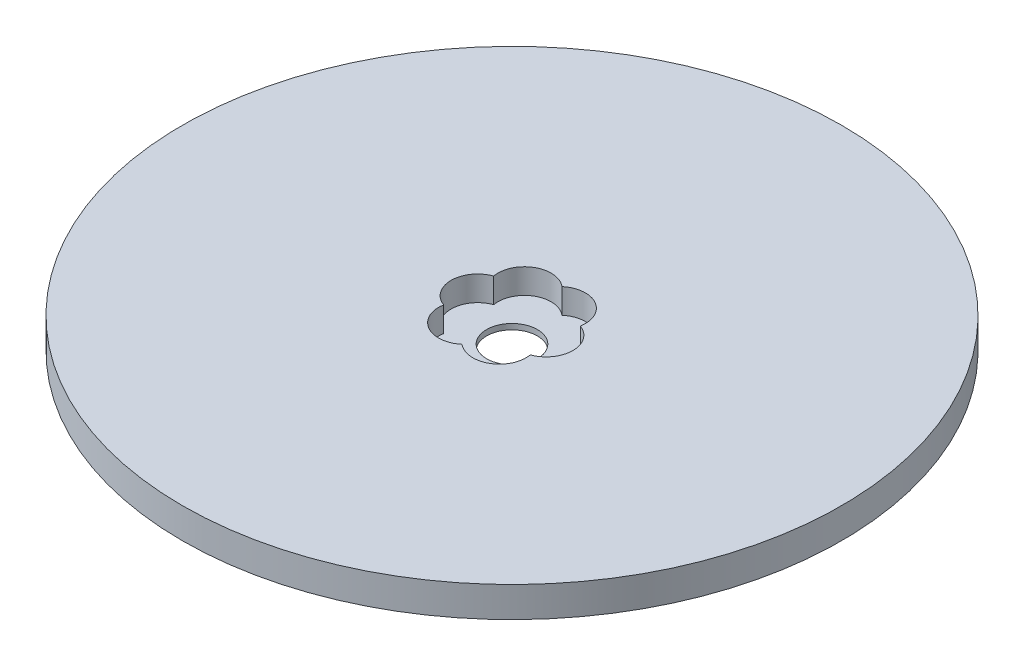
ISO-10303-21;
HEADER;
FILE_DESCRIPTION(('STEP AP214'),'2;1');
FILE_NAME('part.step','',(''),(''),'','','');
FILE_SCHEMA(('AUTOMOTIVE_DESIGN { 1 0 10303 214 1 1 1 1 }'));
ENDSEC;
DATA;
#1=APPLICATION_CONTEXT('core data for automotive mechanical design processes');
#2=APPLICATION_PROTOCOL_DEFINITION('international standard','automotive_design',2000,#1);
#3=PRODUCT_CONTEXT('',#1,'mechanical');
#4=PRODUCT('Part','Part','',(#3));
#5=PRODUCT_RELATED_PRODUCT_CATEGORY('part','',(#4));
#6=PRODUCT_DEFINITION_FORMATION('','',#4);
#7=PRODUCT_DEFINITION_CONTEXT('part definition',#1,'design');
#8=PRODUCT_DEFINITION('design','',#6,#7);
#9=PRODUCT_DEFINITION_SHAPE('','',#8);
#10=(LENGTH_UNIT() NAMED_UNIT(*) SI_UNIT(.MILLI.,.METRE.));
#11=(NAMED_UNIT(*) PLANE_ANGLE_UNIT() SI_UNIT($,.RADIAN.));
#12=(NAMED_UNIT(*) SI_UNIT($,.STERADIAN.) SOLID_ANGLE_UNIT());
#13=UNCERTAINTY_MEASURE_WITH_UNIT(LENGTH_MEASURE(1.E-05),#10,'distance_accuracy_value','');
#14=(GEOMETRIC_REPRESENTATION_CONTEXT(3) GLOBAL_UNCERTAINTY_ASSIGNED_CONTEXT((#13)) GLOBAL_UNIT_ASSIGNED_CONTEXT((#10,
#11,#12)) REPRESENTATION_CONTEXT('',''));
#15=CARTESIAN_POINT('',(0.,0.,0.));
#16=DIRECTION('',(0.,0.,1.));
#17=DIRECTION('',(1.,0.,0.));
#18=AXIS2_PLACEMENT_3D('',#15,#16,#17);
#19=CARTESIAN_POINT('',(0.,6.,0.));
#20=DIRECTION('',(0.,-1.,0.));
#21=DIRECTION('',(0.,0.,-1.));
#22=AXIS2_PLACEMENT_3D('',#19,#20,#21);
#23=CYLINDRICAL_SURFACE('',#22,5.);
#24=CARTESIAN_POINT('',(0.,0.,0.));
#25=DIRECTION('',(0.,1.,0.));
#26=DIRECTION('',(0.,0.,1.));
#27=AXIS2_PLACEMENT_3D('',#24,#25,#26);
#28=CIRCLE('',#27,5.);
#29=CARTESIAN_POINT('',(0.,0.,5.));
#30=VERTEX_POINT('',#29);
#31=EDGE_CURVE('E142',#30,#30,#28,.T.);
#32=ORIENTED_EDGE('',*,*,#31,.F.);
#33=EDGE_LOOP('',(#32));
#34=FACE_BOUND('',#33,.T.);
#35=CARTESIAN_POINT('',(0.,1.09856407998136,0.));
#36=DIRECTION('',(0.,1.,0.));
#37=DIRECTION('',(0.,0.,1.));
#38=AXIS2_PLACEMENT_3D('',#35,#36,#37);
#39=CIRCLE('',#38,5.);
#40=CARTESIAN_POINT('',(0.,1.09856407998136,5.));
#41=VERTEX_POINT('',#40);
#42=EDGE_CURVE('E11',#41,#41,#39,.T.);
#43=ORIENTED_EDGE('',*,*,#42,.T.);
#44=EDGE_LOOP('',(#43));
#45=FACE_BOUND('',#44,.T.);
#46=ADVANCED_FACE('F39',(#34,#45),#23,.F.);
#47=CARTESIAN_POINT('',(0.,6.,0.));
#48=DIRECTION('',(0.,-1.,0.));
#49=DIRECTION('',(0.,0.,-1.));
#50=AXIS2_PLACEMENT_3D('',#47,#48,#49);
#51=CYLINDRICAL_SURFACE('',#50,65.);
#52=CARTESIAN_POINT('',(0.,6.,0.));
#53=DIRECTION('',(0.,1.,0.));
#54=DIRECTION('',(0.,0.,1.));
#55=AXIS2_PLACEMENT_3D('',#52,#53,#54);
#56=CIRCLE('',#55,65.);
#57=CARTESIAN_POINT('',(0.,6.,65.));
#58=VERTEX_POINT('',#57);
#59=EDGE_CURVE('E50',#58,#58,#56,.T.);
#60=ORIENTED_EDGE('',*,*,#59,.F.);
#61=EDGE_LOOP('',(#60));
#62=FACE_BOUND('',#61,.T.);
#63=CARTESIAN_POINT('',(0.,0.,0.));
#64=DIRECTION('',(0.,1.,0.));
#65=DIRECTION('',(0.,0.,1.));
#66=AXIS2_PLACEMENT_3D('',#63,#64,#65);
#67=CIRCLE('',#66,65.);
#68=CARTESIAN_POINT('',(0.,0.,65.));
#69=VERTEX_POINT('',#68);
#70=EDGE_CURVE('E150',#69,#69,#67,.T.);
#71=ORIENTED_EDGE('',*,*,#70,.T.);
#72=EDGE_LOOP('',(#71));
#73=FACE_BOUND('',#72,.T.);
#74=ADVANCED_FACE('F41',(#62,#73),#51,.T.);
#75=CARTESIAN_POINT('',(0.,6.,0.));
#76=DIRECTION('',(0.,1.,0.));
#77=DIRECTION('',(0.,0.,1.));
#78=AXIS2_PLACEMENT_3D('',#75,#76,#77);
#79=PLANE('',#78);
#80=CARTESIAN_POINT('',(-3.37980679853522,6.,5.85399709482975));
#81=DIRECTION('',(0.,1.,0.));
#82=DIRECTION('',(0.86602540378444,0.,0.499999999999998));
#83=AXIS2_PLACEMENT_3D('',#80,#81,#82);
#84=CIRCLE('',#83,5.24368652337503);
#85=CARTESIAN_POINT('',(-8.5417219734165,6.,4.93156548069497));
#86=VERTEX_POINT('',#85);
#87=CARTESIAN_POINT('',(0.,6.,9.86313096138992));
#88=VERTEX_POINT('',#87);
#89=EDGE_CURVE('E132',#86,#88,#84,.T.);
#90=ORIENTED_EDGE('',*,*,#89,.F.);
#91=CARTESIAN_POINT('',(-6.75961359707047,6.,0.));
#92=DIRECTION('',(0.,1.,0.));
#93=DIRECTION('',(0.,0.,1.));
#94=AXIS2_PLACEMENT_3D('',#91,#92,#93);
#95=CIRCLE('',#94,5.24368652337503);
#96=CARTESIAN_POINT('',(-8.54172197341658,6.,-4.93156548069494));
#97=VERTEX_POINT('',#96);
#98=EDGE_CURVE('E138',#97,#86,#95,.T.);
#99=ORIENTED_EDGE('',*,*,#98,.F.);
#100=CARTESIAN_POINT('',(-3.3798067985353,6.,-5.8539970948297));
#101=DIRECTION('',(0.,1.,0.));
#102=DIRECTION('',(-0.866025403784433,0.,0.50000000000001));
#103=AXIS2_PLACEMENT_3D('',#100,#101,#102);
#104=CIRCLE('',#103,5.24368652337503);
#105=CARTESIAN_POINT('',(-1.02782365951626E-13,6.,-9.86313096138992));
#106=VERTEX_POINT('',#105);
#107=EDGE_CURVE('E53',#106,#97,#104,.T.);
#108=ORIENTED_EDGE('',*,*,#107,.F.);
#109=CARTESIAN_POINT('',(3.37980679853518,6.,-5.85399709482977));
#110=DIRECTION('',(0.,1.,0.));
#111=DIRECTION('',(-0.866025403784443,0.,-0.499999999999992));
#112=AXIS2_PLACEMENT_3D('',#109,#110,#111);
#113=CIRCLE('',#112,5.24368652337503);
#114=CARTESIAN_POINT('',(8.54172197341646,6.,-4.93156548069499));
#115=VERTEX_POINT('',#114);
#116=EDGE_CURVE('E106',#115,#106,#113,.T.);
#117=ORIENTED_EDGE('',*,*,#116,.F.);
#118=CARTESIAN_POINT('',(6.75961359707047,6.,0.));
#119=DIRECTION('',(0.,1.,0.));
#120=DIRECTION('',(0.,0.,-1.));
#121=AXIS2_PLACEMENT_3D('',#118,#119,#120);
#122=CIRCLE('',#121,5.24368652337503);
#123=CARTESIAN_POINT('',(8.54172197341654,6.,4.93156548069495));
#124=VERTEX_POINT('',#123);
#125=EDGE_CURVE('E104',#124,#115,#122,.T.);
#126=ORIENTED_EDGE('',*,*,#125,.F.);
#127=CARTESIAN_POINT('',(3.37980679853526,6.,5.85399709482972));
#128=DIRECTION('',(0.,1.,0.));
#129=DIRECTION('',(0.866025403784436,0.,-0.500000000000004));
#130=AXIS2_PLACEMENT_3D('',#127,#128,#129);
#131=CIRCLE('',#130,5.24368652337503);
#132=EDGE_CURVE('E123',#88,#124,#131,.T.);
#133=ORIENTED_EDGE('',*,*,#132,.F.);
#134=EDGE_LOOP('',(#90,#99,#108,#117,#126,#133));
#135=FACE_BOUND('',#134,.T.);
#136=ORIENTED_EDGE('',*,*,#59,.T.);
#137=EDGE_LOOP('',(#136));
#138=FACE_BOUND('',#137,.T.);
#139=ADVANCED_FACE('F156',(#135,#138),#79,.T.);
#140=CARTESIAN_POINT('',(0.,0.,0.));
#141=DIRECTION('',(0.,1.,0.));
#142=DIRECTION('',(0.,0.,1.));
#143=AXIS2_PLACEMENT_3D('',#140,#141,#142);
#144=PLANE('',#143);
#145=ORIENTED_EDGE('',*,*,#31,.T.);
#146=EDGE_LOOP('',(#145));
#147=FACE_BOUND('',#146,.T.);
#148=ORIENTED_EDGE('',*,*,#70,.F.);
#149=EDGE_LOOP('',(#148));
#150=FACE_BOUND('',#149,.T.);
#151=ADVANCED_FACE('F153',(#147,#150),#144,.F.);
#152=CARTESIAN_POINT('',(-6.75961359707047,1.09856407998136,0.));
#153=DIRECTION('',(0.,1.,0.));
#154=DIRECTION('',(0.,0.,1.));
#155=AXIS2_PLACEMENT_3D('',#152,#153,#154);
#156=CYLINDRICAL_SURFACE('',#155,5.24368652337503);
#157=ORIENTED_EDGE('',*,*,#98,.T.);
#158=DIRECTION('',(0.,1.,0.));
#159=VECTOR('',#158,1.);
#160=CARTESIAN_POINT('',(-8.5417219734165,3.54928203999068,4.93156548069497));
#161=LINE('',#160,#159);
#162=CARTESIAN_POINT('',(-8.5417219734165,1.09856407998136,4.93156548069497));
#163=VERTEX_POINT('',#162);
#164=EDGE_CURVE('E65',#86,#163,#161,.F.);
#165=ORIENTED_EDGE('',*,*,#164,.T.);
#166=CARTESIAN_POINT('',(-6.75961359707047,1.09856407998136,0.));
#167=DIRECTION('',(0.,1.,0.));
#168=DIRECTION('',(0.,0.,1.));
#169=AXIS2_PLACEMENT_3D('',#166,#167,#168);
#170=CIRCLE('',#169,5.24368652337503);
#171=CARTESIAN_POINT('',(-8.54172197341658,1.09856407998136,-4.93156548069494));
#172=VERTEX_POINT('',#171);
#173=EDGE_CURVE('E139',#172,#163,#170,.T.);
#174=ORIENTED_EDGE('',*,*,#173,.F.);
#175=DIRECTION('',(0.,1.,0.));
#176=VECTOR('',#175,1.);
#177=CARTESIAN_POINT('',(-8.54172197341658,3.54928203999068,-4.93156548069494));
#178=LINE('',#177,#176);
#179=EDGE_CURVE('E114',#172,#97,#178,.T.);
#180=ORIENTED_EDGE('',*,*,#179,.T.);
#181=EDGE_LOOP('',(#157,#165,#174,#180));
#182=FACE_BOUND('',#181,.T.);
#183=ADVANCED_FACE('F154',(#182),#156,.F.);
#184=CARTESIAN_POINT('',(-6.75961359707047,1.09856407998136,0.));
#185=DIRECTION('',(0.,1.,0.));
#186=DIRECTION('',(0.,0.,1.));
#187=AXIS2_PLACEMENT_3D('',#184,#185,#186);
#188=PLANE('',#187);
#189=ORIENTED_EDGE('',*,*,#173,.T.);
#190=CARTESIAN_POINT('',(-3.37980679853522,1.09856407998136,5.85399709482975));
#191=DIRECTION('',(0.,1.,0.));
#192=DIRECTION('',(0.86602540378444,0.,0.499999999999998));
#193=AXIS2_PLACEMENT_3D('',#190,#191,#192);
#194=CIRCLE('',#193,5.24368652337503);
#195=CARTESIAN_POINT('',(0.,1.09856407998136,9.86313096138992));
#196=VERTEX_POINT('',#195);
#197=EDGE_CURVE('E133',#163,#196,#194,.T.);
#198=ORIENTED_EDGE('',*,*,#197,.T.);
#199=CARTESIAN_POINT('',(3.37980679853526,1.09856407998136,5.85399709482972));
#200=DIRECTION('',(0.,1.,0.));
#201=DIRECTION('',(0.866025403784436,0.,-0.500000000000004));
#202=AXIS2_PLACEMENT_3D('',#199,#200,#201);
#203=CIRCLE('',#202,5.24368652337503);
#204=CARTESIAN_POINT('',(8.54172197341654,1.09856407998136,4.93156548069495));
#205=VERTEX_POINT('',#204);
#206=EDGE_CURVE('E124',#196,#205,#203,.T.);
#207=ORIENTED_EDGE('',*,*,#206,.T.);
#208=CARTESIAN_POINT('',(6.75961359707047,1.09856407998136,0.));
#209=DIRECTION('',(0.,1.,0.));
#210=DIRECTION('',(0.,0.,-1.));
#211=AXIS2_PLACEMENT_3D('',#208,#209,#210);
#212=CIRCLE('',#211,5.24368652337503);
#213=CARTESIAN_POINT('',(8.54172197341646,1.09856407998136,-4.93156548069498));
#214=VERTEX_POINT('',#213);
#215=EDGE_CURVE('E105',#205,#214,#212,.T.);
#216=ORIENTED_EDGE('',*,*,#215,.T.);
#217=CARTESIAN_POINT('',(3.37980679853518,1.09856407998136,-5.85399709482977));
#218=DIRECTION('',(0.,1.,0.));
#219=DIRECTION('',(-0.866025403784443,0.,-0.499999999999992));
#220=AXIS2_PLACEMENT_3D('',#217,#218,#219);
#221=CIRCLE('',#220,5.24368652337503);
#222=CARTESIAN_POINT('',(-1.0321604682062E-13,1.09856407998136,-9.86313096138992));
#223=VERTEX_POINT('',#222);
#224=EDGE_CURVE('E91',#214,#223,#221,.T.);
#225=ORIENTED_EDGE('',*,*,#224,.T.);
#226=CARTESIAN_POINT('',(-3.3798067985353,1.09856407998136,-5.8539970948297));
#227=DIRECTION('',(0.,1.,0.));
#228=DIRECTION('',(-0.866025403784433,0.,0.50000000000001));
#229=AXIS2_PLACEMENT_3D('',#226,#227,#228);
#230=CIRCLE('',#229,5.24368652337503);
#231=EDGE_CURVE('E97',#223,#172,#230,.T.);
#232=ORIENTED_EDGE('',*,*,#231,.T.);
#233=EDGE_LOOP('',(#189,#198,#207,#216,#225,#232));
#234=FACE_BOUND('',#233,.T.);
#235=ORIENTED_EDGE('',*,*,#42,.F.);
#236=EDGE_LOOP('',(#235));
#237=FACE_BOUND('',#236,.T.);
#238=ADVANCED_FACE('F96',(#234,#237),#188,.T.);
#239=CARTESIAN_POINT('',(-3.37980679853522,1.09856407998136,5.85399709482975));
#240=DIRECTION('',(0.,1.,0.));
#241=DIRECTION('',(0.,0.,1.));
#242=AXIS2_PLACEMENT_3D('',#239,#240,#241);
#243=CYLINDRICAL_SURFACE('',#242,5.24368652337503);
#244=ORIENTED_EDGE('',*,*,#89,.T.);
#245=DIRECTION('',(0.,1.,0.));
#246=VECTOR('',#245,1.);
#247=CARTESIAN_POINT('',(0.,3.54928203999068,9.86313096138992));
#248=LINE('',#247,#246);
#249=EDGE_CURVE('E128',#88,#196,#248,.F.);
#250=ORIENTED_EDGE('',*,*,#249,.T.);
#251=ORIENTED_EDGE('',*,*,#197,.F.);
#252=ORIENTED_EDGE('',*,*,#164,.F.);
#253=EDGE_LOOP('',(#244,#250,#251,#252));
#254=FACE_BOUND('',#253,.T.);
#255=ADVANCED_FACE('F177',(#254),#243,.F.);
#256=CARTESIAN_POINT('',(-3.3798067985353,1.09856407998136,-5.8539970948297));
#257=DIRECTION('',(0.,1.,0.));
#258=DIRECTION('',(0.,0.,1.));
#259=AXIS2_PLACEMENT_3D('',#256,#257,#258);
#260=CYLINDRICAL_SURFACE('',#259,5.24368652337503);
#261=ORIENTED_EDGE('',*,*,#231,.F.);
#262=DIRECTION('',(0.,1.,0.));
#263=VECTOR('',#262,1.);
#264=CARTESIAN_POINT('',(-1.0321604682062E-13,3.54928203999068,-9.86313096138992));
#265=LINE('',#264,#263);
#266=EDGE_CURVE('E107',#106,#223,#265,.F.);
#267=ORIENTED_EDGE('',*,*,#266,.F.);
#268=ORIENTED_EDGE('',*,*,#107,.T.);
#269=ORIENTED_EDGE('',*,*,#179,.F.);
#270=EDGE_LOOP('',(#261,#267,#268,#269));
#271=FACE_BOUND('',#270,.T.);
#272=ADVANCED_FACE('F115',(#271),#260,.F.);
#273=CARTESIAN_POINT('',(3.37980679853526,1.09856407998136,5.85399709482972));
#274=DIRECTION('',(0.,1.,0.));
#275=DIRECTION('',(0.,0.,1.));
#276=AXIS2_PLACEMENT_3D('',#273,#274,#275);
#277=CYLINDRICAL_SURFACE('',#276,5.24368652337503);
#278=ORIENTED_EDGE('',*,*,#132,.T.);
#279=DIRECTION('',(0.,1.,0.));
#280=VECTOR('',#279,1.);
#281=CARTESIAN_POINT('',(8.54172197341654,3.54928203999068,4.93156548069495));
#282=LINE('',#281,#280);
#283=EDGE_CURVE('E118',#124,#205,#282,.F.);
#284=ORIENTED_EDGE('',*,*,#283,.T.);
#285=ORIENTED_EDGE('',*,*,#206,.F.);
#286=ORIENTED_EDGE('',*,*,#249,.F.);
#287=EDGE_LOOP('',(#278,#284,#285,#286));
#288=FACE_BOUND('',#287,.T.);
#289=ADVANCED_FACE('F182',(#288),#277,.F.);
#290=CARTESIAN_POINT('',(6.75961359707047,1.09856407998136,0.));
#291=DIRECTION('',(0.,1.,0.));
#292=DIRECTION('',(0.,0.,1.));
#293=AXIS2_PLACEMENT_3D('',#290,#291,#292);
#294=CYLINDRICAL_SURFACE('',#293,5.24368652337503);
#295=DIRECTION('',(0.,1.,0.));
#296=VECTOR('',#295,1.);
#297=CARTESIAN_POINT('',(8.54172197341646,3.54928203999068,-4.93156548069499));
#298=LINE('',#297,#296);
#299=EDGE_CURVE('E130',#115,#214,#298,.F.);
#300=ORIENTED_EDGE('',*,*,#299,.T.);
#301=ORIENTED_EDGE('',*,*,#215,.F.);
#302=ORIENTED_EDGE('',*,*,#283,.F.);
#303=ORIENTED_EDGE('',*,*,#125,.T.);
#304=EDGE_LOOP('',(#300,#301,#302,#303));
#305=FACE_BOUND('',#304,.T.);
#306=ADVANCED_FACE('F184',(#305),#294,.F.);
#307=CARTESIAN_POINT('',(3.37980679853518,1.09856407998136,-5.85399709482977));
#308=DIRECTION('',(0.,1.,0.));
#309=DIRECTION('',(0.,0.,1.));
#310=AXIS2_PLACEMENT_3D('',#307,#308,#309);
#311=CYLINDRICAL_SURFACE('',#310,5.24368652337503);
#312=ORIENTED_EDGE('',*,*,#116,.T.);
#313=ORIENTED_EDGE('',*,*,#266,.T.);
#314=ORIENTED_EDGE('',*,*,#224,.F.);
#315=ORIENTED_EDGE('',*,*,#299,.F.);
#316=EDGE_LOOP('',(#312,#313,#314,#315));
#317=FACE_BOUND('',#316,.T.);
#318=ADVANCED_FACE('F108',(#317),#311,.F.);
#319=CLOSED_SHELL('',(#46,#74,#139,#151,#183,#238,#255,#272,#289,#306,#318));
#320=MANIFOLD_SOLID_BREP('B2',#319);
#321=ADVANCED_BREP_SHAPE_REPRESENTATION('',(#18,#320),#14);
#322=SHAPE_DEFINITION_REPRESENTATION(#9,#321);
ENDSEC;
END-ISO-10303-21;
